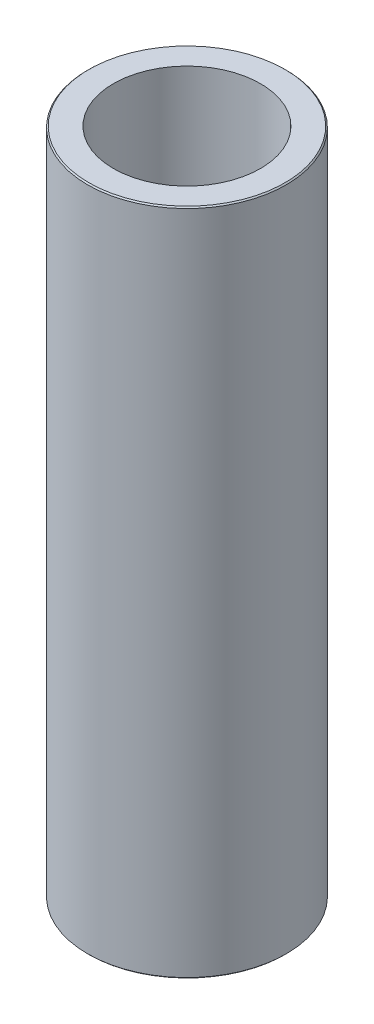
ISO-10303-21;
HEADER;
FILE_DESCRIPTION(('STEP AP214'),'2;1');
FILE_NAME('part.step','',(''),(''),'','','');
FILE_SCHEMA(('AUTOMOTIVE_DESIGN { 1 0 10303 214 1 1 1 1 }'));
ENDSEC;
DATA;
#1=APPLICATION_CONTEXT('core data for automotive mechanical design processes');
#2=APPLICATION_PROTOCOL_DEFINITION('international standard','automotive_design',2000,#1);
#3=PRODUCT_CONTEXT('',#1,'mechanical');
#4=PRODUCT('Part','Part','',(#3));
#5=PRODUCT_RELATED_PRODUCT_CATEGORY('part','',(#4));
#6=PRODUCT_DEFINITION_FORMATION('','',#4);
#7=PRODUCT_DEFINITION_CONTEXT('part definition',#1,'design');
#8=PRODUCT_DEFINITION('design','',#6,#7);
#9=PRODUCT_DEFINITION_SHAPE('','',#8);
#10=(LENGTH_UNIT() NAMED_UNIT(*) SI_UNIT(.MILLI.,.METRE.));
#11=(NAMED_UNIT(*) PLANE_ANGLE_UNIT() SI_UNIT($,.RADIAN.));
#12=(NAMED_UNIT(*) SI_UNIT($,.STERADIAN.) SOLID_ANGLE_UNIT());
#13=UNCERTAINTY_MEASURE_WITH_UNIT(LENGTH_MEASURE(1.E-05),#10,'distance_accuracy_value','');
#14=(GEOMETRIC_REPRESENTATION_CONTEXT(3) GLOBAL_UNCERTAINTY_ASSIGNED_CONTEXT((#13)) GLOBAL_UNIT_ASSIGNED_CONTEXT((#10,
#11,#12)) REPRESENTATION_CONTEXT('',''));
#15=CARTESIAN_POINT('',(0.,0.,0.));
#16=DIRECTION('',(0.,0.,1.));
#17=DIRECTION('',(1.,0.,0.));
#18=AXIS2_PLACEMENT_3D('',#15,#16,#17);
#19=CARTESIAN_POINT('',(0.,168.235638256359,0.));
#20=DIRECTION('',(0.,-1.,0.));
#21=DIRECTION('',(0.,0.,-1.));
#22=AXIS2_PLACEMENT_3D('',#19,#20,#21);
#23=CYLINDRICAL_SURFACE('',#22,25.);
#24=CARTESIAN_POINT('',(0.,167.930854715987,0.));
#25=DIRECTION('',(0.,1.,0.));
#26=DIRECTION('',(0.,0.,1.));
#27=AXIS2_PLACEMENT_3D('',#24,#25,#26);
#28=CIRCLE('',#27,25.);
#29=CARTESIAN_POINT('',(0.,167.930854715987,25.));
#30=VERTEX_POINT('',#29);
#31=EDGE_CURVE('E50',#30,#30,#28,.F.);
#32=ORIENTED_EDGE('',*,*,#31,.T.);
#33=EDGE_LOOP('',(#32));
#34=FACE_BOUND('',#33,.T.);
#35=CARTESIAN_POINT('',(0.,0.304783540372028,0.));
#36=DIRECTION('',(0.,1.,0.));
#37=DIRECTION('',(0.,0.,1.));
#38=AXIS2_PLACEMENT_3D('',#35,#36,#37);
#39=CIRCLE('',#38,25.);
#40=CARTESIAN_POINT('',(0.,0.304783540372028,25.));
#41=VERTEX_POINT('',#40);
#42=EDGE_CURVE('E51',#41,#41,#39,.T.);
#43=ORIENTED_EDGE('',*,*,#42,.T.);
#44=EDGE_LOOP('',(#43));
#45=FACE_BOUND('',#44,.T.);
#46=ADVANCED_FACE('F39',(#34,#45),#23,.T.);
#47=CARTESIAN_POINT('',(0.,168.235638256359,0.));
#48=DIRECTION('',(0.,1.,0.));
#49=DIRECTION('',(0.,0.,1.));
#50=AXIS2_PLACEMENT_3D('',#47,#48,#49);
#51=PLANE('',#50);
#52=CARTESIAN_POINT('',(0.,168.235638256359,0.));
#53=DIRECTION('',(0.,1.,0.));
#54=DIRECTION('',(0.,0.,1.));
#55=AXIS2_PLACEMENT_3D('',#52,#53,#54);
#56=CIRCLE('',#55,24.6952164596279);
#57=CARTESIAN_POINT('',(0.,168.235638256359,24.6952164596279));
#58=VERTEX_POINT('',#57);
#59=EDGE_CURVE('E54',#58,#58,#56,.T.);
#60=ORIENTED_EDGE('',*,*,#59,.T.);
#61=EDGE_LOOP('',(#60));
#62=FACE_BOUND('',#61,.T.);
#63=CARTESIAN_POINT('',(0.,168.235638256359,0.));
#64=DIRECTION('',(0.,1.,0.));
#65=DIRECTION('',(0.,0.,1.));
#66=AXIS2_PLACEMENT_3D('',#63,#64,#65);
#67=CIRCLE('',#66,18.5135629566525);
#68=CARTESIAN_POINT('',(0.,168.235638256359,18.5135629566525));
#69=VERTEX_POINT('',#68);
#70=EDGE_CURVE('E58',#69,#69,#67,.T.);
#71=ORIENTED_EDGE('',*,*,#70,.F.);
#72=EDGE_LOOP('',(#71));
#73=FACE_BOUND('',#72,.T.);
#74=ADVANCED_FACE('F69',(#62,#73),#51,.T.);
#75=CARTESIAN_POINT('',(0.,0.,0.));
#76=DIRECTION('',(0.,1.,0.));
#77=DIRECTION('',(0.,0.,1.));
#78=AXIS2_PLACEMENT_3D('',#75,#76,#77);
#79=PLANE('',#78);
#80=CARTESIAN_POINT('',(0.,0.,0.));
#81=DIRECTION('',(0.,1.,0.));
#82=DIRECTION('',(0.,0.,1.));
#83=AXIS2_PLACEMENT_3D('',#80,#81,#82);
#84=CIRCLE('',#83,24.695216459628);
#85=CARTESIAN_POINT('',(0.,0.,24.695216459628));
#86=VERTEX_POINT('',#85);
#87=EDGE_CURVE('E10',#86,#86,#84,.F.);
#88=ORIENTED_EDGE('',*,*,#87,.T.);
#89=EDGE_LOOP('',(#88));
#90=FACE_BOUND('',#89,.T.);
#91=CARTESIAN_POINT('',(0.,0.,0.));
#92=DIRECTION('',(0.,1.,0.));
#93=DIRECTION('',(0.,0.,1.));
#94=AXIS2_PLACEMENT_3D('',#91,#92,#93);
#95=CIRCLE('',#94,18.5135629566525);
#96=CARTESIAN_POINT('',(0.,0.,18.5135629566525));
#97=VERTEX_POINT('',#96);
#98=EDGE_CURVE('E63',#97,#97,#95,.T.);
#99=ORIENTED_EDGE('',*,*,#98,.T.);
#100=EDGE_LOOP('',(#99));
#101=FACE_BOUND('',#100,.T.);
#102=ADVANCED_FACE('F75',(#90,#101),#79,.F.);
#103=CARTESIAN_POINT('',(0.,168.235638256359,0.));
#104=DIRECTION('',(0.,-1.,0.));
#105=DIRECTION('',(0.,0.,-1.));
#106=AXIS2_PLACEMENT_3D('',#103,#104,#105);
#107=CYLINDRICAL_SURFACE('',#106,18.5135629566525);
#108=ORIENTED_EDGE('',*,*,#70,.T.);
#109=EDGE_LOOP('',(#108));
#110=FACE_BOUND('',#109,.T.);
#111=ORIENTED_EDGE('',*,*,#98,.F.);
#112=EDGE_LOOP('',(#111));
#113=FACE_BOUND('',#112,.T.);
#114=ADVANCED_FACE('F70',(#110,#113),#107,.F.);
#115=CARTESIAN_POINT('',(0.,168.235638256359,0.));
#116=DIRECTION('',(0.,-1.,0.));
#117=DIRECTION('',(0.,0.,-1.));
#118=AXIS2_PLACEMENT_3D('',#115,#116,#117);
#119=CONICAL_SURFACE('',#118,24.6952164596279,0.78539816339746);
#120=ORIENTED_EDGE('',*,*,#31,.F.);
#121=EDGE_LOOP('',(#120));
#122=FACE_BOUND('',#121,.T.);
#123=ORIENTED_EDGE('',*,*,#59,.F.);
#124=EDGE_LOOP('',(#123));
#125=FACE_BOUND('',#124,.T.);
#126=ADVANCED_FACE('F81',(#122,#125),#119,.T.);
#127=CARTESIAN_POINT('',(0.,0.304783540372028,0.));
#128=DIRECTION('',(0.,1.,0.));
#129=DIRECTION('',(0.,0.,1.));
#130=AXIS2_PLACEMENT_3D('',#127,#128,#129);
#131=CONICAL_SURFACE('',#130,25.,0.785398163397431);
#132=CARTESIAN_POINT('',(0.,0.,24.695216459628));
#133=CARTESIAN_POINT('',(0.,0.00317482854554201,24.6983912881735));
#134=CARTESIAN_POINT('',(0.,0.00634965709108391,24.7015661167191));
#135=CARTESIAN_POINT('',(0.,0.0126993141821677,24.7079157738102));
#136=CARTESIAN_POINT('',(0.,0.0158741427277096,24.7110906023557));
#137=CARTESIAN_POINT('',(0.,0.0222237998187937,24.7174402594468));
#138=CARTESIAN_POINT('',(0.,0.025398628364336,24.7206150879923));
#139=CARTESIAN_POINT('',(0.,0.0317482854554197,24.7269647450834));
#140=CARTESIAN_POINT('',(0.,0.0349231140009613,24.7301395736289));
#141=CARTESIAN_POINT('',(0.,0.041272771092045,24.73648923072));
#142=CARTESIAN_POINT('',(0.,0.0444475996375872,24.7396640592656));
#143=CARTESIAN_POINT('',(0.,0.0507972567286713,24.7460137163567));
#144=CARTESIAN_POINT('',(0.,0.0539720852742132,24.7491885449022));
#145=CARTESIAN_POINT('',(0.,0.0603217423652971,24.7555382019933));
#146=CARTESIAN_POINT('',(0.,0.0634965709108391,24.7587130305388));
#147=CARTESIAN_POINT('',(0.,0.069846228001923,24.7650626876299));
#148=CARTESIAN_POINT('',(0.,0.0730210565474649,24.7682375161754));
#149=CARTESIAN_POINT('',(0.,0.0793707136385489,24.7745871732665));
#150=CARTESIAN_POINT('',(0.,0.0825455421840912,24.7777620018121));
#151=CARTESIAN_POINT('',(0.,0.0888951992751749,24.7841116589032));
#152=CARTESIAN_POINT('',(0.,0.0920700278207165,24.7872864874487));
#153=CARTESIAN_POINT('',(0.,0.0984196849118002,24.7936361445398));
#154=CARTESIAN_POINT('',(0.,0.101594513457342,24.7968109730853));
#155=CARTESIAN_POINT('',(0.,0.107944170548427,24.8031606301764));
#156=CARTESIAN_POINT('',(0.,0.111118999093968,24.8063354587219));
#157=CARTESIAN_POINT('',(0.,0.117468656185052,24.812685115813));
#158=CARTESIAN_POINT('',(0.,0.120643484730594,24.8158599443586));
#159=CARTESIAN_POINT('',(0.,0.126993141821678,24.8222096014497));
#160=CARTESIAN_POINT('',(0.,0.13016797036722,24.8253844299952));
#161=CARTESIAN_POINT('',(0.,0.136517627458304,24.8317340870863));
#162=CARTESIAN_POINT('',(0.,0.139692456003846,24.8349089156318));
#163=CARTESIAN_POINT('',(0.,0.14604211309493,24.8412585727229));
#164=CARTESIAN_POINT('',(0.,0.149216941640472,24.8444334012684));
#165=CARTESIAN_POINT('',(0.,0.155566598731556,24.8507830583595));
#166=CARTESIAN_POINT('',(0.,0.158741427277098,24.8539578869051));
#167=CARTESIAN_POINT('',(0.,0.165091084368181,24.8603075439962));
#168=CARTESIAN_POINT('',(0.,0.168265912913724,24.8634823725417));
#169=CARTESIAN_POINT('',(0.,0.174615570004808,24.8698320296328));
#170=CARTESIAN_POINT('',(0.,0.17779039855035,24.8730068581783));
#171=CARTESIAN_POINT('',(0.,0.184140055641433,24.8793565152694));
#172=CARTESIAN_POINT('',(0.,0.187314884186975,24.882531343815));
#173=CARTESIAN_POINT('',(0.,0.193664541278059,24.888881000906));
#174=CARTESIAN_POINT('',(0.,0.196839369823601,24.8920558294516));
#175=CARTESIAN_POINT('',(0.,0.203189026914685,24.8984054865427));
#176=CARTESIAN_POINT('',(0.,0.206363855460228,24.9015803150882));
#177=CARTESIAN_POINT('',(0.,0.212713512551311,24.9079299721793));
#178=CARTESIAN_POINT('',(0.,0.215888341096853,24.9111048007248));
#179=CARTESIAN_POINT('',(0.,0.222237998187937,24.9174544578159));
#180=CARTESIAN_POINT('',(0.,0.225412826733479,24.9206292863615));
#181=CARTESIAN_POINT('',(0.,0.231762483824563,24.9269789434525));
#182=CARTESIAN_POINT('',(0.,0.234937312370105,24.9301537719981));
#183=CARTESIAN_POINT('',(0.,0.241286969461189,24.9365034290892));
#184=CARTESIAN_POINT('',(0.,0.244461798006731,24.9396782576347));
#185=CARTESIAN_POINT('',(0.,0.250811455097815,24.9460279147258));
#186=CARTESIAN_POINT('',(0.,0.253986283643356,24.9492027432713));
#187=CARTESIAN_POINT('',(0.,0.260335940734441,24.9555524003624));
#188=CARTESIAN_POINT('',(0.,0.263510769279983,24.958727228908));
#189=CARTESIAN_POINT('',(0.,0.269860426371066,24.965076885999));
#190=CARTESIAN_POINT('',(0.,0.273035254916608,24.9682517145446));
#191=CARTESIAN_POINT('',(0.,0.279384912007692,24.9746013716357));
#192=CARTESIAN_POINT('',(0.,0.282559740553234,24.9777762001812));
#193=CARTESIAN_POINT('',(0.,0.288909397644318,24.9841258572723));
#194=CARTESIAN_POINT('',(0.,0.29208422618986,24.9873006858178));
#195=CARTESIAN_POINT('',(0.,0.298433883280944,24.9936503429089));
#196=CARTESIAN_POINT('',(0.,0.301608711826486,24.9968251714545));
#197=CARTESIAN_POINT('',(0.,0.304783540372028,25.));
#198=B_SPLINE_CURVE_WITH_KNOTS('',3,(#132,#133,#134,#135,#136,#137,#138,#139,#140,#141,#142,
#143,#144,#145,#146,#147,#148,#149,#150,#151,#152,#153,#154,#155,#156,#157,#158,#159,#160,#161,
#162,#163,#164,#165,#166,#167,#168,#169,#170,#171,#172,#173,#174,#175,#176,#177,#178,#179,#180,
#181,#182,#183,#184,#185,#186,#187,#188,#189,#190,#191,#192,#193,#194,#195,#196,#197),
.UNSPECIFIED.,.F.,.F.,(4,2,2,2,2,2,2,2,2,2,2,2,2,2,2,2,2,2,2,2,2,2,2,2,2,2,2,2,2,2,2,2,4),(0.,
0.0134696567619434,0.0269393135238869,0.0404089702858303,0.0538786270477762,0.0673482838097196,
0.0808179405716631,0.0942875973336065,0.10775725409555,0.121226910857493,0.134696567619439,
0.148166224381383,0.161635881143326,0.17510553790527,0.188575194667213,0.202044851429156,
0.2155145081911,0.228984164953046,0.242453821714989,0.255923478476933,0.269393135238876,
0.28286279200082,0.296332448762763,0.309802105524709,0.323271762286652,0.336741419048596,
0.350211075810539,0.363680732572483,0.377150389334426,0.390620046096372,0.404089702858315,
0.417559359620259,0.431029016382202),.UNSPECIFIED.);
#199=EDGE_CURVE('BSEAM45',#86,#41,#198,.T.);
#200=ORIENTED_EDGE('',*,*,#87,.F.);
#201=ORIENTED_EDGE('',*,*,#42,.F.);
#202=ORIENTED_EDGE('',*,*,#199,.T.);
#203=ORIENTED_EDGE('',*,*,#199,.F.);
#204=EDGE_LOOP('',(#200,#202,#201,#203));
#205=FACE_BOUND('',#204,.T.);
#206=ADVANCED_FACE('F45',(#205),#131,.T.);
#207=CLOSED_SHELL('',(#46,#74,#102,#114,#126,#206));
#208=MANIFOLD_SOLID_BREP('B2',#207);
#209=ADVANCED_BREP_SHAPE_REPRESENTATION('',(#18,#208),#14);
#210=SHAPE_DEFINITION_REPRESENTATION(#9,#209);
ENDSEC;
END-ISO-10303-21;
